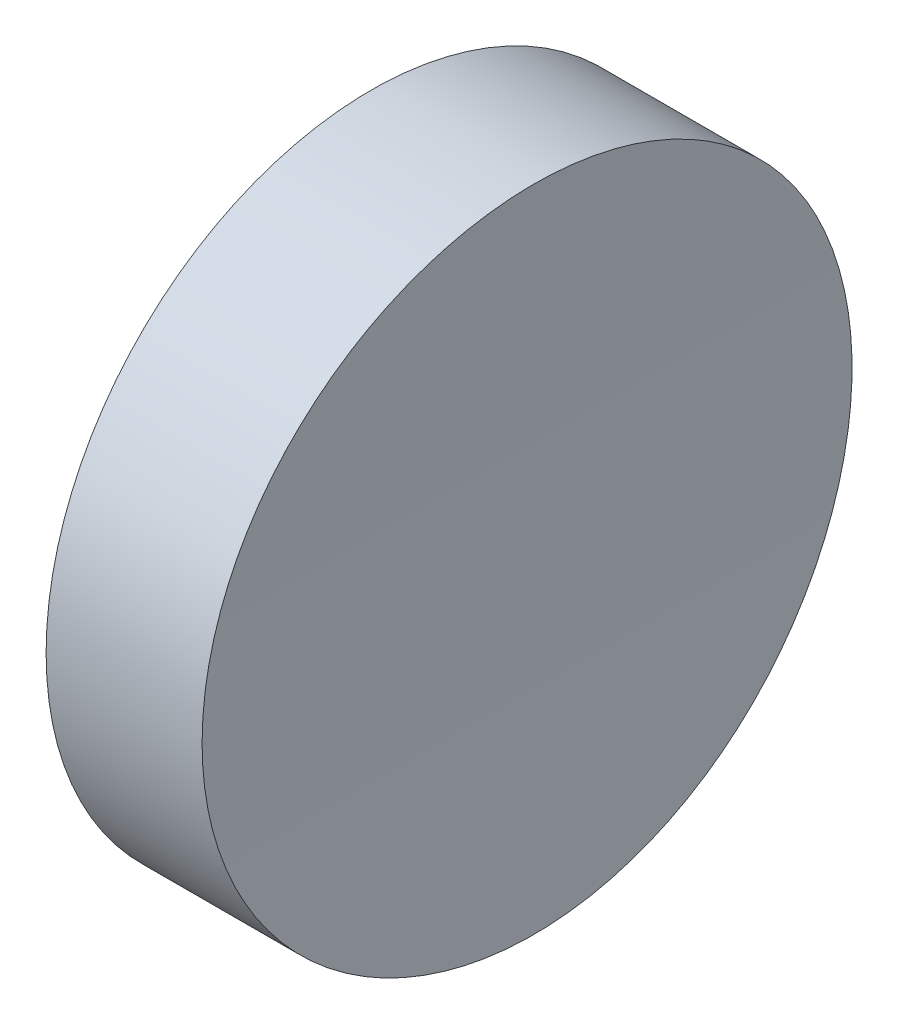
ISO-10303-21;
HEADER;
FILE_DESCRIPTION(('STEP AP214'),'2;1');
FILE_NAME('part.step','',(''),(''),'','','');
FILE_SCHEMA(('AUTOMOTIVE_DESIGN { 1 0 10303 214 1 1 1 1 }'));
ENDSEC;
DATA;
#1=APPLICATION_CONTEXT('core data for automotive mechanical design processes');
#2=APPLICATION_PROTOCOL_DEFINITION('international standard','automotive_design',2000,#1);
#3=PRODUCT_CONTEXT('',#1,'mechanical');
#4=PRODUCT('Part','Part','',(#3));
#5=PRODUCT_RELATED_PRODUCT_CATEGORY('part','',(#4));
#6=PRODUCT_DEFINITION_FORMATION('','',#4);
#7=PRODUCT_DEFINITION_CONTEXT('part definition',#1,'design');
#8=PRODUCT_DEFINITION('design','',#6,#7);
#9=PRODUCT_DEFINITION_SHAPE('','',#8);
#10=(LENGTH_UNIT() NAMED_UNIT(*) SI_UNIT(.MILLI.,.METRE.));
#11=(NAMED_UNIT(*) PLANE_ANGLE_UNIT() SI_UNIT($,.RADIAN.));
#12=(NAMED_UNIT(*) SI_UNIT($,.STERADIAN.) SOLID_ANGLE_UNIT());
#13=UNCERTAINTY_MEASURE_WITH_UNIT(LENGTH_MEASURE(1.E-05),#10,'distance_accuracy_value','');
#14=(GEOMETRIC_REPRESENTATION_CONTEXT(3) GLOBAL_UNCERTAINTY_ASSIGNED_CONTEXT((#13)) GLOBAL_UNIT_ASSIGNED_CONTEXT((#10,
#11,#12)) REPRESENTATION_CONTEXT('',''));
#15=CARTESIAN_POINT('',(0.,0.,0.));
#16=DIRECTION('',(0.,0.,1.));
#17=DIRECTION('',(1.,0.,0.));
#18=AXIS2_PLACEMENT_3D('',#15,#16,#17);
#19=CARTESIAN_POINT('',(10.,0.,0.));
#20=DIRECTION('',(-1.,0.,0.));
#21=DIRECTION('',(0.,0.,1.));
#22=AXIS2_PLACEMENT_3D('',#19,#20,#21);
#23=CYLINDRICAL_SURFACE('',#22,12.5);
#24=CARTESIAN_POINT('',(5.99999999999995,0.,12.5));
#25=CARTESIAN_POINT('',(5.99999969125359,0.351027833637084,12.500002672332));
#26=CARTESIAN_POINT('',(6.0006173918966,0.702012372403462,12.4852075397803));
#27=CARTESIAN_POINT('',(6.00307027914012,1.40160157085059,12.4261314119805));
#28=CARTESIAN_POINT('',(6.00490578113846,1.75020559036594,12.3818427782131));
#29=CARTESIAN_POINT('',(6.00974549536739,2.44280257484652,12.2640226496987));
#30=CARTESIAN_POINT('',(6.01275094474034,2.78679025869438,12.1904601979758));
#31=CARTESIAN_POINT('',(6.01984501103293,3.46733513449983,12.0146201688858));
#32=CARTESIAN_POINT('',(6.02393362443395,3.80389235059115,11.9123426847983));
#33=CARTESIAN_POINT('',(6.03307565171598,4.46701336382446,11.6798619322659));
#34=CARTESIAN_POINT('',(6.03812857514942,4.79358214353644,11.5496728555067));
#35=CARTESIAN_POINT('',(6.04905737846418,5.43459183557242,11.2622638674701));
#36=CARTESIAN_POINT('',(6.05493327110176,5.74903255981174,11.1050435371919));
#37=CARTESIAN_POINT('',(6.0673398668155,6.36347398507577,10.7647343585126));
#38=CARTESIAN_POINT('',(6.07387040784818,6.66347823244749,10.5816519071293));
#39=CARTESIAN_POINT('',(6.0874025041834,7.2470029054023,10.1908904147322));
#40=CARTESIAN_POINT('',(6.09440405789999,7.53052338648194,9.98321145653546));
#41=CARTESIAN_POINT('',(6.10868453102818,8.07925117286997,9.5445876580047));
#42=CARTESIAN_POINT('',(6.11596362720317,8.34444649424907,9.31362783112019));
#43=CARTESIAN_POINT('',(6.13058848703947,8.8544415264244,8.83019345471525));
#44=CARTESIAN_POINT('',(6.13793425079022,9.09924120985163,8.57771887632501));
#45=CARTESIAN_POINT('',(6.15248437088859,9.56671720766257,8.05303565724387));
#46=CARTESIAN_POINT('',(6.15968872157251,9.7893926373996,7.78082622819964));
#47=CARTESIAN_POINT('',(6.17375128193886,10.2110279076674,7.21861302866805));
#48=CARTESIAN_POINT('',(6.18060949165479,10.4099877504937,6.92860925990311));
#49=CARTESIAN_POINT('',(6.19378736739639,10.7828425906677,6.33276103677151));
#50=CARTESIAN_POINT('',(6.20010684556008,10.9567288590646,6.02691111595634));
#51=CARTESIAN_POINT('',(6.21202496992028,11.2781160008707,5.40163533819122));
#52=CARTESIAN_POINT('',(6.21762361587306,11.4256168653588,5.08220947665108));
#53=CARTESIAN_POINT('',(6.22794081999527,11.6931805936305,4.43205371343552));
#54=CARTESIAN_POINT('',(6.23265938255075,11.8132435941565,4.1013238681053));
#55=CARTESIAN_POINT('',(6.24108217309358,12.025075048616,3.43091114453497));
#56=CARTESIAN_POINT('',(6.24478640170674,12.1168435200063,3.09122827181869));
#57=CARTESIAN_POINT('',(6.25107321650711,12.2713844822218,2.40552849501202));
#58=CARTESIAN_POINT('',(6.25365645875126,12.3341739343807,2.05951541958987));
#59=CARTESIAN_POINT('',(6.25763096103127,12.4303872149002,1.363423534515));
#60=CARTESIAN_POINT('',(6.25902222148509,12.4638110535574,1.01334472628789));
#61=CARTESIAN_POINT('',(6.26057316182859,12.5010538853979,0.311615114509819));
#62=CARTESIAN_POINT('',(6.26073284853879,12.5048730425332,-0.0400356803246329));
#63=CARTESIAN_POINT('',(6.259816112748,12.4828796040343,-0.742407719520131));
#64=CARTESIAN_POINT('',(6.25873969065536,12.4570670181886,-1.0931289641882));
#65=CARTESIAN_POINT('',(6.25538242539101,12.3760201380997,-1.79092761221709));
#66=CARTESIAN_POINT('',(6.25310233345774,12.32080419499,-2.13800715080607));
#67=CARTESIAN_POINT('',(6.24740298399762,12.1813564317068,-2.82627775475158));
#68=CARTESIAN_POINT('',(6.24398372701877,12.0971246254917,-3.16746882294072));
#69=CARTESIAN_POINT('',(6.23610316874752,11.9002459010648,-3.84154022336256));
#70=CARTESIAN_POINT('',(6.23164186476723,11.7875989095582,-4.17442053415582));
#71=CARTESIAN_POINT('',(6.22180388345263,11.5346926763865,-4.82950722989098));
#72=CARTESIAN_POINT('',(6.21642720568618,11.3944334216861,-5.15171360979387));
#73=CARTESIAN_POINT('',(6.20490923525184,11.0872525631867,-5.78326674180014));
#74=CARTESIAN_POINT('',(6.1987677029201,10.9203225975772,-6.09260942241229));
#75=CARTESIAN_POINT('',(6.18589562975313,10.561018918502,-6.69613432627437));
#76=CARTESIAN_POINT('',(6.17916508883722,10.3686452015508,-6.99031654744744));
#77=CARTESIAN_POINT('',(6.16530585440163,9.95981937746724,-7.5614368815938));
#78=CARTESIAN_POINT('',(6.15817715929419,9.74336717431038,-7.83837492579074));
#79=CARTESIAN_POINT('',(6.14372371886729,9.28792047669188,-8.3730435915633));
#80=CARTESIAN_POINT('',(6.1363989734429,9.04892597016469,-8.63077420285819));
#81=CARTESIAN_POINT('',(6.12175541748176,8.54989857660156,-9.1253902096331));
#82=CARTESIAN_POINT('',(6.11443661571828,8.28984979972981,-9.36225957412033));
#83=CARTESIAN_POINT('',(6.10001821124483,7.75071756817197,-9.81325081063358));
#84=CARTESIAN_POINT('',(6.09291860865381,7.4716341031559,-10.0273726703146));
#85=CARTESIAN_POINT('',(6.07914003687237,6.89641276123542,-10.431347458341));
#86=CARTESIAN_POINT('',(6.07246106790739,6.60027487519075,-10.6212003736794));
#87=CARTESIAN_POINT('',(6.05971328486704,5.99304689750456,-10.9752865334395));
#88=CARTESIAN_POINT('',(6.05364447064779,5.68195680938917,-11.139519783903));
#89=CARTESIAN_POINT('',(6.04228911219153,5.04702711987458,-11.4411999532012));
#90=CARTESIAN_POINT('',(6.03700258417569,4.72318725427745,-11.5786463166128));
#91=CARTESIAN_POINT('',(6.02736202684025,4.06506572435435,-11.8257680017069));
#92=CARTESIAN_POINT('',(6.02300799761471,3.73078405897523,-11.9354433205884));
#93=CARTESIAN_POINT('',(6.0153560972242,3.05415824435199,-12.12623903831));
#94=CARTESIAN_POINT('',(6.0120582215493,2.71181412954238,-12.2073595590832));
#95=CARTESIAN_POINT('',(6.00661228105001,2.0214991425453,-12.3404661179147));
#96=CARTESIAN_POINT('',(6.00446421548873,1.67352827396408,-12.3924521746449));
#97=CARTESIAN_POINT('',(6.0013800786346,0.974701109344858,-12.466889755562));
#98=CARTESIAN_POINT('',(6.00044309770447,0.623847178326479,-12.4893634464859));
#99=CARTESIAN_POINT('',(5.99980473131182,-0.0785080560541103,-12.504687950631));
#100=CARTESIAN_POINT('',(6.0001033452339,-0.430009359093802,-12.4975387786061));
#101=CARTESIAN_POINT('',(6.00192769358141,-1.13115765835506,-12.4536687581771));
#102=CARTESIAN_POINT('',(6.00345342530561,-1.48080465865677,-12.4169479748684));
#103=CARTESIAN_POINT('',(6.00768871989657,-2.17575794786144,-12.3141973666764));
#104=CARTESIAN_POINT('',(6.01039828271008,-2.52106423695968,-12.2481675431116));
#105=CARTESIAN_POINT('',(6.01692323293303,-3.20476079661667,-12.0872989143029));
#106=CARTESIAN_POINT('',(6.02073823191672,-3.54315345183953,-11.9924702277789));
#107=CARTESIAN_POINT('',(6.02936630945992,-4.21074487012324,-11.7746722342981));
#108=CARTESIAN_POINT('',(6.03417938770043,-4.53994363612254,-11.6517029363353));
#109=CARTESIAN_POINT('',(6.04466728507831,-5.18681279391368,-11.3784991763417));
#110=CARTESIAN_POINT('',(6.05034210686389,-5.50448315027402,-11.2282646305222));
#111=CARTESIAN_POINT('',(6.06239275751978,-6.12604255201395,-10.9015991713275));
#112=CARTESIAN_POINT('',(6.06876858682277,-6.42993158888717,-10.7251682417831));
#113=CARTESIAN_POINT('',(6.08204467574418,-7.02195194061094,-10.3472504507296));
#114=CARTESIAN_POINT('',(6.08894524583711,-7.31007375033465,-10.1457487099583));
#115=CARTESIAN_POINT('',(6.10307187661356,-7.86832130206293,-9.71920343278176));
#116=CARTESIAN_POINT('',(6.11029793741314,-8.13844703765082,-9.49415988798249));
#117=CARTESIAN_POINT('',(6.12487075326172,-8.65878859283302,-9.02212686649413));
#118=CARTESIAN_POINT('',(6.13221750880414,-8.90900433101033,-8.77513730007098));
#119=CARTESIAN_POINT('',(6.14682340962712,-9.38775052565581,-8.26096441701981));
#120=CARTESIAN_POINT('',(6.15408255487969,-9.61628097519418,-7.99378109393868));
#121=CARTESIAN_POINT('',(6.16831176162805,-10.0501686727213,-7.44094463386193));
#122=CARTESIAN_POINT('',(6.17528164258673,-10.25551158236,-7.15528023868054));
#123=CARTESIAN_POINT('',(6.18872960906541,-10.6414020125544,-6.56765684514669));
#124=CARTESIAN_POINT('',(6.19520769435101,-10.8219495212913,-6.26569783902747));
#125=CARTESIAN_POINT('',(6.20748795097852,-11.1569633542178,-5.64763036138685));
#126=CARTESIAN_POINT('',(6.21329012411756,-11.3114297477532,-5.33152192748948));
#127=CARTESIAN_POINT('',(6.2240535847792,-11.5931807304632,-4.68740111050116));
#128=CARTESIAN_POINT('',(6.22901487270675,-11.7204653327277,-4.35938873314281));
#129=CARTESIAN_POINT('',(6.2379539437907,-11.9469071432238,-3.69390128384838));
#130=CARTESIAN_POINT('',(6.24193204773819,-12.0460735273639,-3.35642933847898));
#131=CARTESIAN_POINT('',(6.24879367744482,-12.2156258872498,-2.67432032594371));
#132=CARTESIAN_POINT('',(6.25167720336365,-12.2860118671942,-2.32968325982315));
#133=CARTESIAN_POINT('',(6.25626759709462,-12.3974999051613,-1.63569775389896));
#134=CARTESIAN_POINT('',(6.25797446796001,-12.4386020391716,-1.28634932632308));
#135=CARTESIAN_POINT('',(6.26016296223808,-12.4912284825971,-0.585427945654642));
#136=CARTESIAN_POINT('',(6.26064458630094,-12.5027528077082,-0.233854993742668));
#137=CARTESIAN_POINT('',(6.2603689824336,-12.4961437148136,0.468743749214013));
#138=CARTESIAN_POINT('',(6.25961269680808,-12.4780328553013,0.819769753043072));
#139=CARTESIAN_POINT('',(6.25688456089484,-12.4123255155447,1.51904622322746));
#140=CARTESIAN_POINT('',(6.25491271126537,-12.3647290512673,1.86729669108569));
#141=CARTESIAN_POINT('',(6.24980949878417,-12.2403905015513,2.55854693375083));
#142=CARTESIAN_POINT('',(6.24667813406873,-12.1636483692663,2.90154670011732));
#143=CARTESIAN_POINT('',(6.23934487592333,-11.9815663456011,3.57985796036706));
#144=CARTESIAN_POINT('',(6.23514298224805,-11.8762264476674,3.91516945248847));
#145=CARTESIAN_POINT('',(6.22578795954922,-11.6376986356399,4.57572727145245));
#146=CARTESIAN_POINT('',(6.22063481923871,-11.504510391111,4.90097347881263));
#147=CARTESIAN_POINT('',(6.20952362157847,-11.2112350885949,5.53908913121134));
#148=CARTESIAN_POINT('',(6.20356556414677,-11.0511480278688,5.85195857498963));
#149=CARTESIAN_POINT('',(6.19101378026834,-10.7052193451175,6.46309232753591));
#150=CARTESIAN_POINT('',(6.18442007537277,-10.5193785961591,6.76135713094704));
#151=CARTESIAN_POINT('',(6.17078377741627,-10.1232581920961,7.3411797482166));
#152=CARTESIAN_POINT('',(6.1637411845172,-9.91297854580382,7.62273756809929));
#153=CARTESIAN_POINT('',(6.14940200695061,-9.4693270729897,8.16732984631656));
#154=CARTESIAN_POINT('',(6.14210525981589,-9.23594029295431,8.4303521186536));
#155=CARTESIAN_POINT('',(6.1274690557672,-8.74784430287862,8.93580726132118));
#156=CARTESIAN_POINT('',(6.12012959866737,-8.49313499997664,9.17824004197322));
#157=CARTESIAN_POINT('',(6.10561429188925,-7.96413416588453,9.64085376219675));
#158=CARTESIAN_POINT('',(6.09843848407283,-7.68983769676462,9.86102905661543));
#159=CARTESIAN_POINT('',(6.08445607483369,-7.12367033712322,10.2774907432595));
#160=CARTESIAN_POINT('',(6.07764946767964,-6.83179971956444,10.47377750638));
#161=CARTESIAN_POINT('',(6.06459309730363,-6.23230549519288,10.8412208519961));
#162=CARTESIAN_POINT('',(6.05834379378685,-5.92466920708174,11.0123567622408));
#163=CARTESIAN_POINT('',(6.0465858698998,-5.29605207973544,11.3280866935995));
#164=CARTESIAN_POINT('',(6.04107725196086,-4.9750711967009,11.4726806275895));
#165=CARTESIAN_POINT('',(6.03096272243936,-4.32238976726839,11.7341549987797));
#166=CARTESIAN_POINT('',(6.0263558568635,-3.99070098677421,11.851064751757));
#167=CARTESIAN_POINT('',(6.01816923384539,-3.31875359958295,12.0565046278735));
#168=CARTESIAN_POINT('',(6.01458920958734,-2.97849724413769,12.1450421239993));
#169=CARTESIAN_POINT('',(6.00777421790798,-2.20256957065,12.3123660542274));
#170=CARTESIAN_POINT('',(6.00486956414436,-1.7650396611502,12.3826677460878));
#171=CARTESIAN_POINT('',(6.00098265033026,-0.884983570699583,12.4764830211982));
#172=CARTESIAN_POINT('',(6.00000038916313,-0.442457392651077,12.4999966316259));
#173=CARTESIAN_POINT('',(5.99999999999995,0.,12.5));
#174=B_SPLINE_CURVE_WITH_KNOTS('',3,(#24,#25,#26,#27,#28,#29,#30,#31,#32,#33,#34,#35,#36,#37,
#38,#39,#40,#41,#42,#43,#44,#45,#46,#47,#48,#49,#50,#51,#52,#53,#54,#55,#56,#57,#58,#59,#60,#61,
#62,#63,#64,#65,#66,#67,#68,#69,#70,#71,#72,#73,#74,#75,#76,#77,#78,#79,#80,#81,#82,#83,#84,#85,
#86,#87,#88,#89,#90,#91,#92,#93,#94,#95,#96,#97,#98,#99,#100,#101,#102,#103,#104,#105,#106,#107,
#108,#109,#110,#111,#112,#113,#114,#115,#116,#117,#118,#119,#120,#121,#122,#123,#124,#125,#126,
#127,#128,#129,#130,#131,#132,#133,#134,#135,#136,#137,#138,#139,#140,#141,#142,#143,#144,#145,
#146,#147,#148,#149,#150,#151,#152,#153,#154,#155,#156,#157,#158,#159,#160,#161,#162,#163,#164,
#165,#166,#167,#168,#169,#170,#171,#172,#173),.UNSPECIFIED.,.T.,.F.,(4,2,2,2,2,2,2,2,2,2,2,2,2,
2,2,2,2,2,2,2,2,2,2,2,2,2,2,2,2,2,2,2,2,2,2,2,2,2,2,2,2,2,2,2,2,2,2,2,2,2,2,2,2,2,2,2,2,2,2,2,2,
2,2,2,2,2,2,2,2,2,2,2,2,2,4),(0.,1.05269694193418,2.10566662784527,3.15975279778865,
4.21383554361895,5.26738360540322,6.32094799928977,7.37425224795808,8.42755295021995,
9.48153607518497,10.5355206144713,11.5895472807828,12.6435738450683,13.6979664699384,
14.7523594513136,15.8067471777874,16.8611342537413,17.9149034149981,18.9686722067713,
20.0224351627268,21.0761977705844,22.1293034768208,23.1824086764534,24.235516592523,
25.2886250057431,26.3420642401156,27.3955036188007,28.4489471987347,29.502391342517,
30.5566380762465,31.6108853821117,32.6651332530025,33.7193808752742,34.7736503549297,
35.8279199409183,36.8821850249674,37.936449433354,38.989921530007,40.0433931019653,
41.0968623549436,42.1503315605327,43.2034310483631,44.2565301996082,45.3096325871803,
46.3627356247582,47.4164666761679,48.4701981032941,49.5239338391718,50.5776699117822,
51.6320540498306,52.6864386904517,53.7408205275784,54.7952018569513,55.8492387096301,
56.9032754085382,57.9573093723551,59.0113427768346,60.0645742174717,61.1178050877658,
62.1710376509378,63.224270455467,64.2775157578589,65.330761167496,66.3839708801578,
67.4371802130473,68.4910756292811,69.5449756355714,70.5991422747552,71.6532925447822,
72.7083044645556,73.7633198473441,74.8172129897678,75.8708320386207,77.197717744253,
78.5246026791426),.UNSPECIFIED.);
#175=CARTESIAN_POINT('',(5.99999999999995,0.,12.5));
#176=VERTEX_POINT('',#175);
#177=EDGE_CURVE('E10',#176,#176,#174,.T.);
#178=ORIENTED_EDGE('',*,*,#177,.T.);
#179=EDGE_LOOP('',(#178));
#180=FACE_BOUND('',#179,.T.);
#181=CARTESIAN_POINT('',(0.,0.,0.));
#182=DIRECTION('',(1.,0.,0.));
#183=DIRECTION('',(0.,0.,-1.));
#184=AXIS2_PLACEMENT_3D('',#181,#182,#183);
#185=CIRCLE('',#184,12.5);
#186=CARTESIAN_POINT('',(0.,0.,-12.5));
#187=VERTEX_POINT('',#186);
#188=EDGE_CURVE('E46',#187,#187,#185,.T.);
#189=ORIENTED_EDGE('',*,*,#188,.T.);
#190=EDGE_LOOP('',(#189));
#191=FACE_BOUND('',#190,.T.);
#192=ADVANCED_FACE('F35',(#180,#191),#23,.T.);
#193=CARTESIAN_POINT('',(0.,0.,0.));
#194=DIRECTION('',(1.,0.,0.));
#195=DIRECTION('',(0.,0.,-1.));
#196=AXIS2_PLACEMENT_3D('',#193,#194,#195);
#197=PLANE('',#196);
#198=ORIENTED_EDGE('',*,*,#188,.F.);
#199=EDGE_LOOP('',(#198));
#200=FACE_BOUND('',#199,.T.);
#201=ADVANCED_FACE('F53',(#200),#197,.F.);
#202=CARTESIAN_POINT('',(306.,0.,-12.5));
#203=DIRECTION('',(0.,0.,1.));
#204=DIRECTION('',(1.,0.,0.));
#205=AXIS2_PLACEMENT_3D('',#202,#203,#204);
#206=CYLINDRICAL_SURFACE('',#205,300.);
#207=ORIENTED_EDGE('',*,*,#177,.F.);
#208=EDGE_LOOP('',(#207));
#209=FACE_BOUND('',#208,.T.);
#210=ADVANCED_FACE('F55',(#209),#206,.F.);
#211=CLOSED_SHELL('',(#192,#201,#210));
#212=MANIFOLD_SOLID_BREP('B2',#211);
#213=ADVANCED_BREP_SHAPE_REPRESENTATION('',(#18,#212),#14);
#214=SHAPE_DEFINITION_REPRESENTATION(#9,#213);
ENDSEC;
END-ISO-10303-21;
